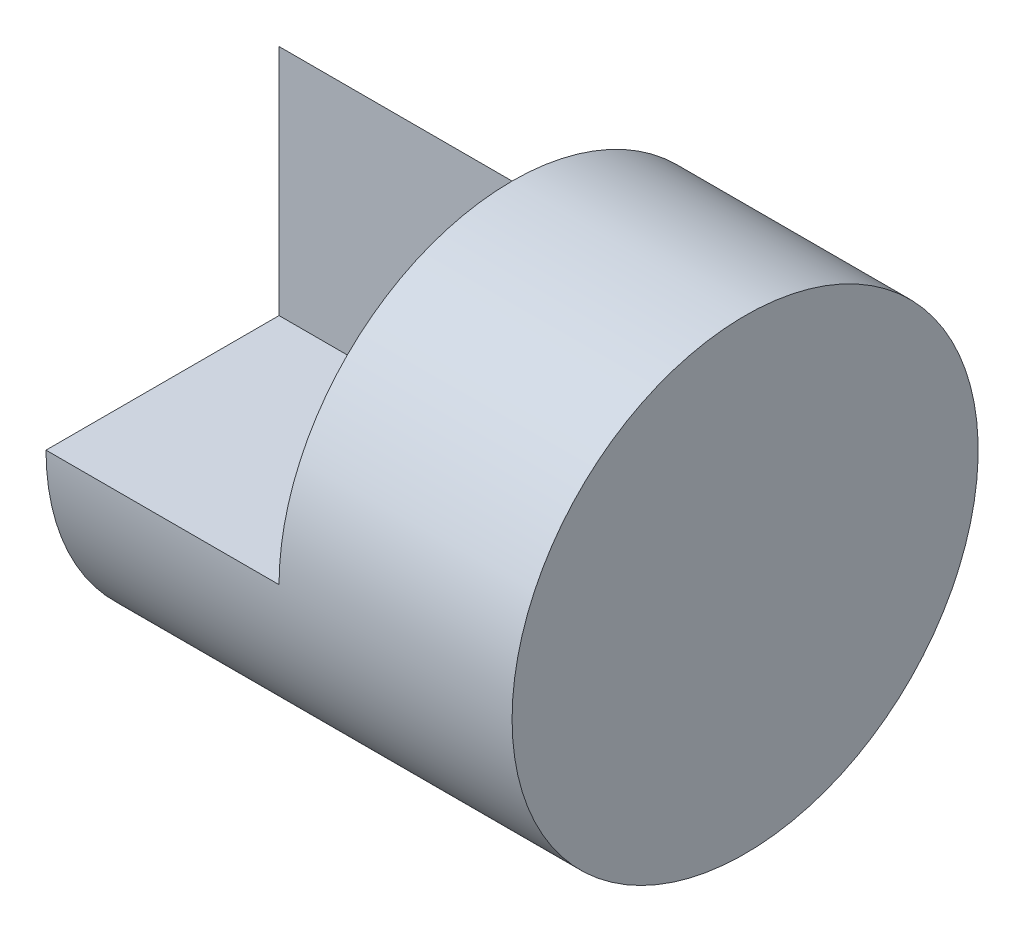
ISO-10303-21;
HEADER;
FILE_DESCRIPTION(('STEP AP214'),'2;1');
FILE_NAME('part.step','',(''),(''),'','','');
FILE_SCHEMA(('AUTOMOTIVE_DESIGN { 1 0 10303 214 1 1 1 1 }'));
ENDSEC;
DATA;
#1=APPLICATION_CONTEXT('core data for automotive mechanical design processes');
#2=APPLICATION_PROTOCOL_DEFINITION('international standard','automotive_design',2000,#1);
#3=PRODUCT_CONTEXT('',#1,'mechanical');
#4=PRODUCT('Part','Part','',(#3));
#5=PRODUCT_RELATED_PRODUCT_CATEGORY('part','',(#4));
#6=PRODUCT_DEFINITION_FORMATION('','',#4);
#7=PRODUCT_DEFINITION_CONTEXT('part definition',#1,'design');
#8=PRODUCT_DEFINITION('design','',#6,#7);
#9=PRODUCT_DEFINITION_SHAPE('','',#8);
#10=(LENGTH_UNIT() NAMED_UNIT(*) SI_UNIT(.MILLI.,.METRE.));
#11=(NAMED_UNIT(*) PLANE_ANGLE_UNIT() SI_UNIT($,.RADIAN.));
#12=(NAMED_UNIT(*) SI_UNIT($,.STERADIAN.) SOLID_ANGLE_UNIT());
#13=UNCERTAINTY_MEASURE_WITH_UNIT(LENGTH_MEASURE(1.E-05),#10,'distance_accuracy_value','');
#14=(GEOMETRIC_REPRESENTATION_CONTEXT(3) GLOBAL_UNCERTAINTY_ASSIGNED_CONTEXT((#13)) GLOBAL_UNIT_ASSIGNED_CONTEXT((#10,
#11,#12)) REPRESENTATION_CONTEXT('',''));
#15=CARTESIAN_POINT('',(0.,0.,0.));
#16=DIRECTION('',(0.,0.,1.));
#17=DIRECTION('',(1.,0.,0.));
#18=AXIS2_PLACEMENT_3D('',#15,#16,#17);
#19=CARTESIAN_POINT('',(0.,0.,0.));
#20=DIRECTION('',(0.,0.,-1.));
#21=DIRECTION('',(-1.,0.,0.));
#22=AXIS2_PLACEMENT_3D('',#19,#20,#21);
#23=PLANE('',#22);
#24=DIRECTION('',(0.,-1.,0.));
#25=VECTOR('',#24,1.);
#26=CARTESIAN_POINT('',(-2.,0.,0.));
#27=LINE('',#26,#25);
#28=CARTESIAN_POINT('',(-2.,4.,0.));
#29=VERTEX_POINT('',#28);
#30=CARTESIAN_POINT('',(-2.,2.,0.));
#31=VERTEX_POINT('',#30);
#32=EDGE_CURVE('E118',#29,#31,#27,.T.);
#33=ORIENTED_EDGE('',*,*,#32,.T.);
#34=DIRECTION('',(-1.,0.,0.));
#35=VECTOR('',#34,1.);
#36=CARTESIAN_POINT('',(0.,2.,0.));
#37=LINE('',#36,#35);
#38=CARTESIAN_POINT('',(0.,2.,0.));
#39=VERTEX_POINT('',#38);
#40=EDGE_CURVE('E77',#39,#31,#37,.T.);
#41=ORIENTED_EDGE('',*,*,#40,.F.);
#42=DIRECTION('',(0.,-1.,0.));
#43=VECTOR('',#42,1.);
#44=CARTESIAN_POINT('',(0.,0.,0.));
#45=LINE('',#44,#43);
#46=CARTESIAN_POINT('',(0.,4.,0.));
#47=VERTEX_POINT('',#46);
#48=EDGE_CURVE('E112',#47,#39,#45,.T.);
#49=ORIENTED_EDGE('',*,*,#48,.F.);
#50=DIRECTION('',(-1.,0.,0.));
#51=VECTOR('',#50,1.);
#52=CARTESIAN_POINT('',(0.,4.,0.));
#53=LINE('',#52,#51);
#54=EDGE_CURVE('E62',#47,#29,#53,.T.);
#55=ORIENTED_EDGE('',*,*,#54,.T.);
#56=EDGE_LOOP('',(#33,#41,#49,#55));
#57=FACE_BOUND('',#56,.T.);
#58=ADVANCED_FACE('F54',(#57),#23,.F.);
#59=CARTESIAN_POINT('',(0.,0.,0.));
#60=DIRECTION('',(-1.,0.,0.));
#61=DIRECTION('',(0.,0.,1.));
#62=AXIS2_PLACEMENT_3D('',#59,#60,#61);
#63=PLANE('',#62);
#64=DIRECTION('',(0.,0.707106781186548,0.707106781186548));
#65=VECTOR('',#64,1.);
#66=CARTESIAN_POINT('',(0.,2.,-2.));
#67=LINE('',#66,#65);
#68=CARTESIAN_POINT('',(0.,2.,-2.));
#69=VERTEX_POINT('',#68);
#70=EDGE_CURVE('E121',#69,#47,#67,.T.);
#71=ORIENTED_EDGE('',*,*,#70,.T.);
#72=CARTESIAN_POINT('',(0.,2.,0.));
#73=DIRECTION('',(-1.,0.,0.));
#74=DIRECTION('',(0.,0.,1.));
#75=AXIS2_PLACEMENT_3D('',#72,#73,#74);
#76=CIRCLE('',#75,2.);
#77=EDGE_CURVE('E69',#47,#69,#76,.T.);
#78=ORIENTED_EDGE('',*,*,#77,.T.);
#79=EDGE_LOOP('',(#71,#78));
#80=FACE_BOUND('',#79,.T.);
#81=ADVANCED_FACE('F135',(#80),#63,.T.);
#82=CARTESIAN_POINT('',(0.,2.,-2.));
#83=DIRECTION('',(0.,-0.707106781186547,0.707106781186547));
#84=DIRECTION('',(0.,-0.707106781186548,-0.707106781186548));
#85=AXIS2_PLACEMENT_3D('',#82,#83,#84);
#86=PLANE('',#85);
#87=DIRECTION('',(0.,0.707106781186548,0.707106781186548));
#88=VECTOR('',#87,1.);
#89=CARTESIAN_POINT('',(-2.,2.,-2.));
#90=LINE('',#89,#88);
#91=CARTESIAN_POINT('',(-2.,2.,-2.));
#92=VERTEX_POINT('',#91);
#93=EDGE_CURVE('E109',#92,#29,#90,.T.);
#94=ORIENTED_EDGE('',*,*,#93,.T.);
#95=ORIENTED_EDGE('',*,*,#54,.F.);
#96=ORIENTED_EDGE('',*,*,#70,.F.);
#97=DIRECTION('',(-1.,0.,0.));
#98=VECTOR('',#97,1.);
#99=CARTESIAN_POINT('',(0.,2.,-2.));
#100=LINE('',#99,#98);
#101=EDGE_CURVE('E94',#69,#92,#100,.T.);
#102=ORIENTED_EDGE('',*,*,#101,.T.);
#103=EDGE_LOOP('',(#94,#95,#96,#102));
#104=FACE_BOUND('',#103,.T.);
#105=ADVANCED_FACE('F129',(#104),#86,.F.);
#106=CARTESIAN_POINT('',(0.,0.,0.));
#107=DIRECTION('',(-1.,0.,0.));
#108=DIRECTION('',(0.,0.,1.));
#109=AXIS2_PLACEMENT_3D('',#106,#107,#108);
#110=PLANE('',#109);
#111=DIRECTION('',(0.,0.,1.));
#112=VECTOR('',#111,1.);
#113=CARTESIAN_POINT('',(0.,2.,0.));
#114=LINE('',#113,#112);
#115=CARTESIAN_POINT('',(0.,2.,2.));
#116=VERTEX_POINT('',#115);
#117=EDGE_CURVE('E106',#39,#116,#114,.T.);
#118=ORIENTED_EDGE('',*,*,#117,.T.);
#119=CARTESIAN_POINT('',(0.,2.,0.));
#120=DIRECTION('',(-1.,0.,0.));
#121=DIRECTION('',(0.,0.,1.));
#122=AXIS2_PLACEMENT_3D('',#119,#120,#121);
#123=CIRCLE('',#122,2.);
#124=EDGE_CURVE('E12',#116,#47,#123,.T.);
#125=ORIENTED_EDGE('',*,*,#124,.T.);
#126=ORIENTED_EDGE('',*,*,#48,.T.);
#127=EDGE_LOOP('',(#118,#125,#126));
#128=FACE_BOUND('',#127,.T.);
#129=ADVANCED_FACE('F111',(#128),#110,.T.);
#130=CARTESIAN_POINT('',(0.,2.,0.));
#131=DIRECTION('',(0.,-1.,0.));
#132=DIRECTION('',(0.,0.,-1.));
#133=AXIS2_PLACEMENT_3D('',#130,#131,#132);
#134=PLANE('',#133);
#135=DIRECTION('',(0.,0.,1.));
#136=VECTOR('',#135,1.);
#137=CARTESIAN_POINT('',(-2.,2.,0.));
#138=LINE('',#137,#136);
#139=CARTESIAN_POINT('',(-2.,2.,2.));
#140=VERTEX_POINT('',#139);
#141=EDGE_CURVE('E108',#31,#140,#138,.T.);
#142=ORIENTED_EDGE('',*,*,#141,.T.);
#143=DIRECTION('',(-1.,0.,0.));
#144=VECTOR('',#143,1.);
#145=CARTESIAN_POINT('',(0.,2.,2.));
#146=LINE('',#145,#144);
#147=EDGE_CURVE('E101',#116,#140,#146,.T.);
#148=ORIENTED_EDGE('',*,*,#147,.F.);
#149=ORIENTED_EDGE('',*,*,#117,.F.);
#150=ORIENTED_EDGE('',*,*,#40,.T.);
#151=EDGE_LOOP('',(#142,#148,#149,#150));
#152=FACE_BOUND('',#151,.T.);
#153=ADVANCED_FACE('F105',(#152),#134,.F.);
#154=CARTESIAN_POINT('',(-2.,4.,2.));
#155=DIRECTION('',(1.,0.,0.));
#156=DIRECTION('',(0.,0.,-1.));
#157=AXIS2_PLACEMENT_3D('',#154,#155,#156);
#158=PLANE('',#157);
#159=CARTESIAN_POINT('',(-2.,2.,0.));
#160=DIRECTION('',(1.,0.,0.));
#161=DIRECTION('',(0.,0.,-1.));
#162=AXIS2_PLACEMENT_3D('',#159,#160,#161);
#163=CIRCLE('',#162,2.);
#164=EDGE_CURVE('E91',#140,#92,#163,.T.);
#165=ORIENTED_EDGE('',*,*,#164,.F.);
#166=ORIENTED_EDGE('',*,*,#141,.F.);
#167=ORIENTED_EDGE('',*,*,#32,.F.);
#168=ORIENTED_EDGE('',*,*,#93,.F.);
#169=EDGE_LOOP('',(#165,#166,#167,#168));
#170=FACE_BOUND('',#169,.T.);
#171=ADVANCED_FACE('F133',(#170),#158,.F.);
#172=CARTESIAN_POINT('',(30.,2.,0.));
#173=DIRECTION('',(-1.,0.,0.));
#174=DIRECTION('',(0.,0.,1.));
#175=AXIS2_PLACEMENT_3D('',#172,#173,#174);
#176=CYLINDRICAL_SURFACE('',#175,2.);
#177=ORIENTED_EDGE('',*,*,#77,.F.);
#178=ORIENTED_EDGE('',*,*,#124,.F.);
#179=ORIENTED_EDGE('',*,*,#147,.T.);
#180=ORIENTED_EDGE('',*,*,#164,.T.);
#181=ORIENTED_EDGE('',*,*,#101,.F.);
#182=EDGE_LOOP('',(#177,#178,#179,#180,#181));
#183=FACE_BOUND('',#182,.T.);
#184=CARTESIAN_POINT('',(2.,2.,0.));
#185=DIRECTION('',(-1.,0.,0.));
#186=DIRECTION('',(0.,0.,1.));
#187=AXIS2_PLACEMENT_3D('',#184,#185,#186);
#188=CIRCLE('',#187,2.);
#189=CARTESIAN_POINT('',(2.,2.,2.));
#190=VERTEX_POINT('',#189);
#191=EDGE_CURVE('E136',#190,#190,#188,.T.);
#192=ORIENTED_EDGE('',*,*,#191,.T.);
#193=EDGE_LOOP('',(#192));
#194=FACE_BOUND('',#193,.T.);
#195=ADVANCED_FACE('F99',(#183,#194),#176,.T.);
#196=CARTESIAN_POINT('',(2.,4.,2.));
#197=DIRECTION('',(-1.,0.,0.));
#198=DIRECTION('',(0.,0.,1.));
#199=AXIS2_PLACEMENT_3D('',#196,#197,#198);
#200=PLANE('',#199);
#201=ORIENTED_EDGE('',*,*,#191,.F.);
#202=EDGE_LOOP('',(#201));
#203=FACE_BOUND('',#202,.T.);
#204=ADVANCED_FACE('F56',(#203),#200,.F.);
#205=CLOSED_SHELL('',(#58,#81,#105,#129,#153,#171,#195,#204));
#206=MANIFOLD_SOLID_BREP('B2',#205);
#207=ADVANCED_BREP_SHAPE_REPRESENTATION('',(#18,#206),#14);
#208=SHAPE_DEFINITION_REPRESENTATION(#9,#207);
ENDSEC;
END-ISO-10303-21;
